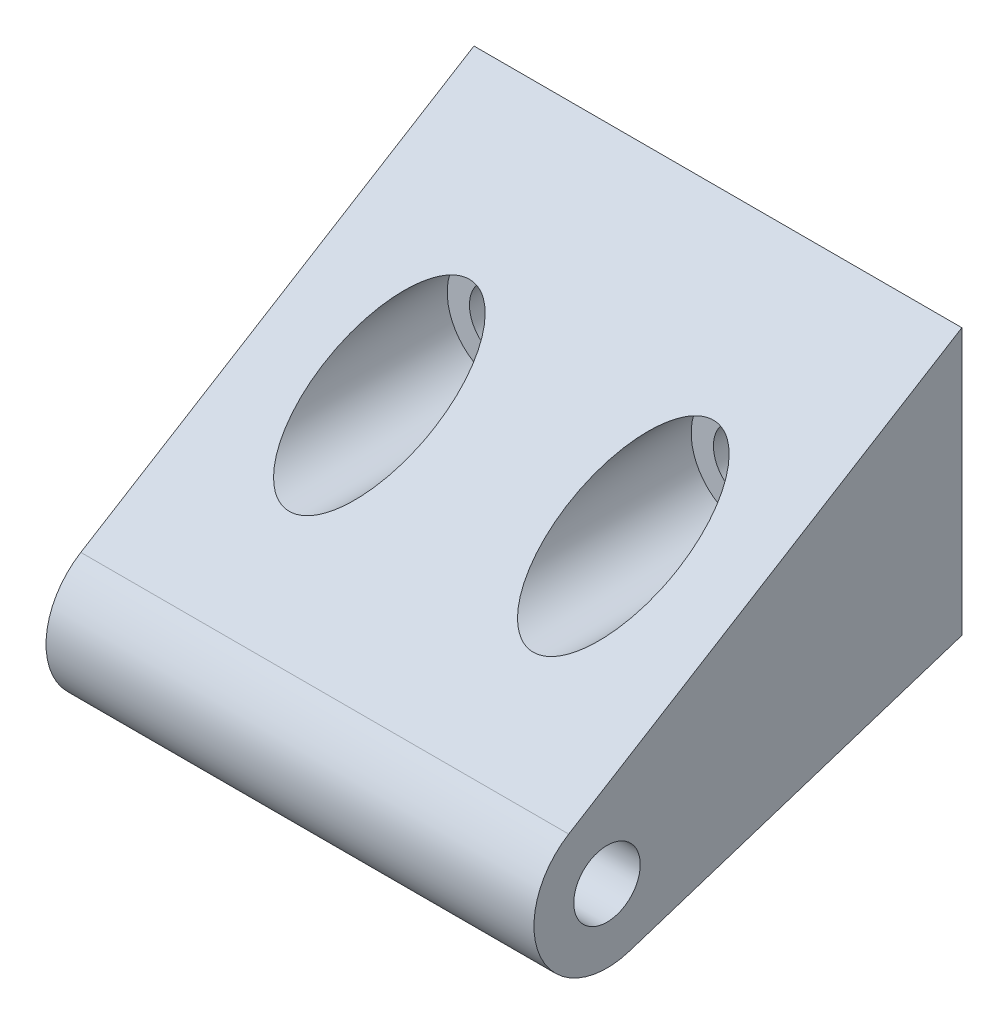
ISO-10303-21;
HEADER;
FILE_DESCRIPTION(('STEP AP214'),'2;1');
FILE_NAME('part.step','',(''),(''),'','','');
FILE_SCHEMA(('AUTOMOTIVE_DESIGN { 1 0 10303 214 1 1 1 1 }'));
ENDSEC;
DATA;
#1=APPLICATION_CONTEXT('core data for automotive mechanical design processes');
#2=APPLICATION_PROTOCOL_DEFINITION('international standard','automotive_design',2000,#1);
#3=PRODUCT_CONTEXT('',#1,'mechanical');
#4=PRODUCT('Part','Part','',(#3));
#5=PRODUCT_RELATED_PRODUCT_CATEGORY('part','',(#4));
#6=PRODUCT_DEFINITION_FORMATION('','',#4);
#7=PRODUCT_DEFINITION_CONTEXT('part definition',#1,'design');
#8=PRODUCT_DEFINITION('design','',#6,#7);
#9=PRODUCT_DEFINITION_SHAPE('','',#8);
#10=(LENGTH_UNIT() NAMED_UNIT(*) SI_UNIT(.MILLI.,.METRE.));
#11=(NAMED_UNIT(*) PLANE_ANGLE_UNIT() SI_UNIT($,.RADIAN.));
#12=(NAMED_UNIT(*) SI_UNIT($,.STERADIAN.) SOLID_ANGLE_UNIT());
#13=UNCERTAINTY_MEASURE_WITH_UNIT(LENGTH_MEASURE(1.E-05),#10,'distance_accuracy_value','');
#14=(GEOMETRIC_REPRESENTATION_CONTEXT(3) GLOBAL_UNCERTAINTY_ASSIGNED_CONTEXT((#13)) GLOBAL_UNIT_ASSIGNED_CONTEXT((#10,
#11,#12)) REPRESENTATION_CONTEXT('',''));
#15=CARTESIAN_POINT('',(0.,0.,0.));
#16=DIRECTION('',(0.,0.,1.));
#17=DIRECTION('',(1.,0.,0.));
#18=AXIS2_PLACEMENT_3D('',#15,#16,#17);
#19=CARTESIAN_POINT('',(-17.74444,2.26271294080112,-1.26438571596363));
#20=DIRECTION('',(0.,0.85165570406991,0.524101671171907));
#21=DIRECTION('',(0.,-0.524101671171907,0.85165570406991));
#22=AXIS2_PLACEMENT_3D('',#19,#20,#21);
#23=PLANE('',#22);
#24=CARTESIAN_POINT('',(-4.43738,6.21538000000002,-7.6873979527474));
#25=DIRECTION('',(0.,0.85165570406991,0.524101671171907));
#26=DIRECTION('',(0.,-0.524101671171907,0.85165570406991));
#27=AXIS2_PLACEMENT_3D('',#24,#25,#26);
#28=ELLIPSE('',#27,3.84803199633091,2.01676);
#29=CARTESIAN_POINT('',(-4.43738,4.19862000000002,-4.41019955362866));
#30=VERTEX_POINT('',#29);
#31=EDGE_CURVE('E35',#30,#30,#28,.T.);
#32=ORIENTED_EDGE('',*,*,#31,.F.);
#33=EDGE_LOOP('',(#32));
#34=FACE_BOUND('',#33,.T.);
#35=CARTESIAN_POINT('',(-13.3096,6.21538000000002,-7.6873979527474));
#36=DIRECTION('',(0.,0.85165570406991,0.524101671171907));
#37=DIRECTION('',(0.,-0.524101671171907,0.85165570406991));
#38=AXIS2_PLACEMENT_3D('',#35,#36,#37);
#39=ELLIPSE('',#38,3.84803199633092,2.01676);
#40=CARTESIAN_POINT('',(-13.3096,4.19862000000001,-4.41019955362865));
#41=VERTEX_POINT('',#40);
#42=EDGE_CURVE('E109',#41,#41,#39,.T.);
#43=ORIENTED_EDGE('',*,*,#42,.F.);
#44=EDGE_LOOP('',(#43));
#45=FACE_BOUND('',#44,.T.);
#46=DIRECTION('',(0.,-0.524101671171907,0.85165570406991));
#47=VECTOR('',#46,1.);
#48=CARTESIAN_POINT('',(0.,2.26271294080112,-1.26438571596363));
#49=LINE('',#48,#47);
#50=CARTESIAN_POINT('',(0.,11.0617,-15.56258));
#51=VERTEX_POINT('',#50);
#52=CARTESIAN_POINT('',(0.,2.26271294080112,-1.26438571596363));
#53=VERTEX_POINT('',#52);
#54=EDGE_CURVE('E99',#51,#53,#49,.T.);
#55=ORIENTED_EDGE('',*,*,#54,.F.);
#56=DIRECTION('',(1.,0.,0.));
#57=VECTOR('',#56,1.);
#58=CARTESIAN_POINT('',(-17.74444,11.0617,-15.56258));
#59=LINE('',#58,#57);
#60=CARTESIAN_POINT('',(-17.74444,11.0617,-15.56258));
#61=VERTEX_POINT('',#60);
#62=EDGE_CURVE('E11',#61,#51,#59,.T.);
#63=ORIENTED_EDGE('',*,*,#62,.F.);
#64=DIRECTION('',(0.,-0.524101671171907,0.85165570406991));
#65=VECTOR('',#64,1.);
#66=CARTESIAN_POINT('',(-17.74444,2.26271294080112,-1.26438571596363));
#67=LINE('',#66,#65);
#68=CARTESIAN_POINT('',(-17.74444,2.26271294080112,-1.26438571596363));
#69=VERTEX_POINT('',#68);
#70=EDGE_CURVE('E92',#61,#69,#67,.T.);
#71=ORIENTED_EDGE('',*,*,#70,.T.);
#72=DIRECTION('',(1.,0.,0.));
#73=VECTOR('',#72,1.);
#74=CARTESIAN_POINT('',(-17.74444,2.26271294080112,-1.26438571596363));
#75=LINE('',#74,#73);
#76=EDGE_CURVE('E75',#69,#53,#75,.T.);
#77=ORIENTED_EDGE('',*,*,#76,.T.);
#78=EDGE_LOOP('',(#55,#63,#71,#77));
#79=FACE_BOUND('',#78,.T.);
#80=ADVANCED_FACE('F32',(#34,#45,#79),#23,.T.);
#81=CARTESIAN_POINT('',(-17.74444,11.0617,-15.56258));
#82=DIRECTION('',(0.,0.,-1.));
#83=DIRECTION('',(-1.,0.,0.));
#84=AXIS2_PLACEMENT_3D('',#81,#82,#83);
#85=PLANE('',#84);
#86=CARTESIAN_POINT('',(-4.43738,6.21538000000002,-15.56258));
#87=DIRECTION('',(0.,0.,1.));
#88=DIRECTION('',(1.,0.,0.));
#89=AXIS2_PLACEMENT_3D('',#86,#87,#88);
#90=CIRCLE('',#89,1.20904);
#91=CARTESIAN_POINT('',(-3.22834,6.21538000000002,-15.56258));
#92=VERTEX_POINT('',#91);
#93=EDGE_CURVE('E185',#92,#92,#90,.T.);
#94=ORIENTED_EDGE('',*,*,#93,.T.);
#95=EDGE_LOOP('',(#94));
#96=FACE_BOUND('',#95,.T.);
#97=CARTESIAN_POINT('',(-13.3096,6.21538000000002,-15.56258));
#98=DIRECTION('',(0.,0.,1.));
#99=DIRECTION('',(1.,0.,0.));
#100=AXIS2_PLACEMENT_3D('',#97,#98,#99);
#101=CIRCLE('',#100,1.20904);
#102=CARTESIAN_POINT('',(-12.10056,6.21538000000002,-15.56258));
#103=VERTEX_POINT('',#102);
#104=EDGE_CURVE('E193',#103,#103,#101,.T.);
#105=ORIENTED_EDGE('',*,*,#104,.T.);
#106=EDGE_LOOP('',(#105));
#107=FACE_BOUND('',#106,.T.);
#108=DIRECTION('',(0.,1.,0.));
#109=VECTOR('',#108,1.);
#110=CARTESIAN_POINT('',(0.,11.0617,-15.56258));
#111=LINE('',#110,#109);
#112=CARTESIAN_POINT('',(0.,1.37160000000002,-15.56258));
#113=VERTEX_POINT('',#112);
#114=EDGE_CURVE('E94',#113,#51,#111,.T.);
#115=ORIENTED_EDGE('',*,*,#114,.F.);
#116=DIRECTION('',(1.,0.,0.));
#117=VECTOR('',#116,1.);
#118=CARTESIAN_POINT('',(-17.74444,1.37160000000002,-15.56258));
#119=LINE('',#118,#117);
#120=CARTESIAN_POINT('',(-17.74444,1.37160000000002,-15.56258));
#121=VERTEX_POINT('',#120);
#122=EDGE_CURVE('E41',#121,#113,#119,.T.);
#123=ORIENTED_EDGE('',*,*,#122,.F.);
#124=DIRECTION('',(0.,1.,0.));
#125=VECTOR('',#124,1.);
#126=CARTESIAN_POINT('',(-17.74444,11.0617,-15.56258));
#127=LINE('',#126,#125);
#128=EDGE_CURVE('E89',#121,#61,#127,.T.);
#129=ORIENTED_EDGE('',*,*,#128,.T.);
#130=ORIENTED_EDGE('',*,*,#62,.T.);
#131=EDGE_LOOP('',(#115,#123,#129,#130));
#132=FACE_BOUND('',#131,.T.);
#133=ADVANCED_FACE('F140',(#96,#107,#132),#85,.T.);
#134=CARTESIAN_POINT('',(-17.74444,1.37160000000002,-15.56258));
#135=DIRECTION('',(0.,-0.951706068554315,-0.307010682349799));
#136=DIRECTION('',(0.,0.307010682349799,-0.951706068554315));
#137=AXIS2_PLACEMENT_3D('',#134,#135,#136);
#138=PLANE('',#137);
#139=DIRECTION('',(0.,0.307010682349799,-0.951706068554315));
#140=VECTOR('',#139,1.);
#141=CARTESIAN_POINT('',(0.,1.37160000000002,-15.56258));
#142=LINE('',#141,#140);
#143=CARTESIAN_POINT('',(0.,-2.52853075117783,-3.47251826129424));
#144=VERTEX_POINT('',#143);
#145=EDGE_CURVE('E83',#144,#113,#142,.T.);
#146=ORIENTED_EDGE('',*,*,#145,.F.);
#147=DIRECTION('',(1.,0.,0.));
#148=VECTOR('',#147,1.);
#149=CARTESIAN_POINT('',(-17.74444,-2.52853075117783,-3.47251826129424));
#150=LINE('',#149,#148);
#151=CARTESIAN_POINT('',(-17.74444,-2.52853075117783,-3.47251826129424));
#152=VERTEX_POINT('',#151);
#153=EDGE_CURVE('E78',#152,#144,#150,.T.);
#154=ORIENTED_EDGE('',*,*,#153,.F.);
#155=DIRECTION('',(0.,0.307010682349799,-0.951706068554315));
#156=VECTOR('',#155,1.);
#157=CARTESIAN_POINT('',(-17.74444,1.37160000000002,-15.56258));
#158=LINE('',#157,#156);
#159=EDGE_CURVE('E81',#152,#121,#158,.T.);
#160=ORIENTED_EDGE('',*,*,#159,.T.);
#161=ORIENTED_EDGE('',*,*,#122,.T.);
#162=EDGE_LOOP('',(#146,#154,#160,#161));
#163=FACE_BOUND('',#162,.T.);
#164=ADVANCED_FACE('F80',(#163),#138,.T.);
#165=CARTESIAN_POINT('',(-17.74444,0.,-2.65684));
#166=DIRECTION('',(1.,0.,0.));
#167=DIRECTION('',(0.,0.,-1.));
#168=AXIS2_PLACEMENT_3D('',#165,#166,#167);
#169=CYLINDRICAL_SURFACE('',#168,2.65684);
#170=CARTESIAN_POINT('',(0.,0.,-2.65684));
#171=DIRECTION('',(1.,0.,0.));
#172=DIRECTION('',(0.,0.,-1.));
#173=AXIS2_PLACEMENT_3D('',#170,#171,#172);
#174=CIRCLE('',#173,2.65684);
#175=EDGE_CURVE('E102',#53,#144,#174,.T.);
#176=ORIENTED_EDGE('',*,*,#175,.F.);
#177=ORIENTED_EDGE('',*,*,#76,.F.);
#178=CARTESIAN_POINT('',(-17.74444,0.,-2.65684));
#179=DIRECTION('',(1.,0.,0.));
#180=DIRECTION('',(0.,0.,-1.));
#181=AXIS2_PLACEMENT_3D('',#178,#179,#180);
#182=CIRCLE('',#181,2.65684);
#183=EDGE_CURVE('E88',#69,#152,#182,.T.);
#184=ORIENTED_EDGE('',*,*,#183,.T.);
#185=ORIENTED_EDGE('',*,*,#153,.T.);
#186=EDGE_LOOP('',(#176,#177,#184,#185));
#187=FACE_BOUND('',#186,.T.);
#188=ADVANCED_FACE('F91',(#187),#169,.T.);
#189=CARTESIAN_POINT('',(-17.74444,0.,-2.65684));
#190=DIRECTION('',(1.,0.,0.));
#191=DIRECTION('',(0.,0.,-1.));
#192=AXIS2_PLACEMENT_3D('',#189,#190,#191);
#193=PLANE('',#192);
#194=CARTESIAN_POINT('',(-17.74444,0.,-2.65684));
#195=DIRECTION('',(1.,0.,0.));
#196=DIRECTION('',(0.,0.,-1.));
#197=AXIS2_PLACEMENT_3D('',#194,#195,#196);
#198=CIRCLE('',#197,1.20904);
#199=CARTESIAN_POINT('',(-17.74444,0.,-3.86588));
#200=VERTEX_POINT('',#199);
#201=EDGE_CURVE('E103',#200,#200,#198,.T.);
#202=ORIENTED_EDGE('',*,*,#201,.T.);
#203=EDGE_LOOP('',(#202));
#204=FACE_BOUND('',#203,.T.);
#205=ORIENTED_EDGE('',*,*,#70,.F.);
#206=ORIENTED_EDGE('',*,*,#128,.F.);
#207=ORIENTED_EDGE('',*,*,#159,.F.);
#208=ORIENTED_EDGE('',*,*,#183,.F.);
#209=EDGE_LOOP('',(#205,#206,#207,#208));
#210=FACE_BOUND('',#209,.T.);
#211=ADVANCED_FACE('F87',(#204,#210),#193,.F.);
#212=CARTESIAN_POINT('',(0.,0.,-2.65684));
#213=DIRECTION('',(1.,0.,0.));
#214=DIRECTION('',(0.,0.,-1.));
#215=AXIS2_PLACEMENT_3D('',#212,#213,#214);
#216=PLANE('',#215);
#217=CARTESIAN_POINT('',(0.,0.,-2.65684));
#218=DIRECTION('',(1.,0.,0.));
#219=DIRECTION('',(0.,0.,-1.));
#220=AXIS2_PLACEMENT_3D('',#217,#218,#219);
#221=CIRCLE('',#220,1.20904);
#222=CARTESIAN_POINT('',(0.,0.,-3.86588));
#223=VERTEX_POINT('',#222);
#224=EDGE_CURVE('E111',#223,#223,#221,.T.);
#225=ORIENTED_EDGE('',*,*,#224,.F.);
#226=EDGE_LOOP('',(#225));
#227=FACE_BOUND('',#226,.T.);
#228=ORIENTED_EDGE('',*,*,#54,.T.);
#229=ORIENTED_EDGE('',*,*,#175,.T.);
#230=ORIENTED_EDGE('',*,*,#145,.T.);
#231=ORIENTED_EDGE('',*,*,#114,.T.);
#232=EDGE_LOOP('',(#228,#229,#230,#231));
#233=FACE_BOUND('',#232,.T.);
#234=ADVANCED_FACE('F133',(#227,#233),#216,.T.);
#235=CARTESIAN_POINT('',(-17.74444,0.,-2.65684));
#236=DIRECTION('',(1.,0.,0.));
#237=DIRECTION('',(0.,0.,-1.));
#238=AXIS2_PLACEMENT_3D('',#235,#236,#237);
#239=CYLINDRICAL_SURFACE('',#238,1.20904);
#240=ORIENTED_EDGE('',*,*,#201,.F.);
#241=EDGE_LOOP('',(#240));
#242=FACE_BOUND('',#241,.T.);
#243=ORIENTED_EDGE('',*,*,#224,.T.);
#244=EDGE_LOOP('',(#243));
#245=FACE_BOUND('',#244,.T.);
#246=ADVANCED_FACE('F129',(#242,#245),#239,.F.);
#247=CARTESIAN_POINT('',(-13.3096,6.21538000000002,-12.17243946));
#248=DIRECTION('',(0.,0.,1.));
#249=DIRECTION('',(1.,0.,0.));
#250=AXIS2_PLACEMENT_3D('',#247,#248,#249);
#251=CYLINDRICAL_SURFACE('',#250,2.01676);
#252=ORIENTED_EDGE('',*,*,#42,.T.);
#253=EDGE_LOOP('',(#252));
#254=FACE_BOUND('',#253,.T.);
#255=CARTESIAN_POINT('',(-13.3096,6.21538000000002,-12.17243946));
#256=DIRECTION('',(0.,0.,1.));
#257=DIRECTION('',(1.,0.,0.));
#258=AXIS2_PLACEMENT_3D('',#255,#256,#257);
#259=CIRCLE('',#258,2.01676);
#260=CARTESIAN_POINT('',(-11.29284,6.21538000000002,-12.17243946));
#261=VERTEX_POINT('',#260);
#262=EDGE_CURVE('E112',#261,#261,#259,.T.);
#263=ORIENTED_EDGE('',*,*,#262,.F.);
#264=EDGE_LOOP('',(#263));
#265=FACE_BOUND('',#264,.T.);
#266=ADVANCED_FACE('F132',(#254,#265),#251,.F.);
#267=CARTESIAN_POINT('',(-13.3096,6.21538000000002,-12.17243946));
#268=DIRECTION('',(0.,0.,1.));
#269=DIRECTION('',(1.,0.,0.));
#270=AXIS2_PLACEMENT_3D('',#267,#268,#269);
#271=PLANE('',#270);
#272=CARTESIAN_POINT('',(-13.3096,6.21538000000002,-12.17243946));
#273=DIRECTION('',(0.,0.,1.));
#274=DIRECTION('',(1.,0.,0.));
#275=AXIS2_PLACEMENT_3D('',#272,#273,#274);
#276=CIRCLE('',#275,1.20904);
#277=CARTESIAN_POINT('',(-12.10056,6.21538000000002,-12.17243946));
#278=VERTEX_POINT('',#277);
#279=EDGE_CURVE('E190',#278,#278,#276,.T.);
#280=ORIENTED_EDGE('',*,*,#279,.F.);
#281=EDGE_LOOP('',(#280));
#282=FACE_BOUND('',#281,.T.);
#283=ORIENTED_EDGE('',*,*,#262,.T.);
#284=EDGE_LOOP('',(#283));
#285=FACE_BOUND('',#284,.T.);
#286=ADVANCED_FACE('F162',(#282,#285),#271,.T.);
#287=CARTESIAN_POINT('',(-4.43738,6.21538000000002,-12.17243946));
#288=DIRECTION('',(0.,0.,1.));
#289=DIRECTION('',(1.,0.,0.));
#290=AXIS2_PLACEMENT_3D('',#287,#288,#289);
#291=CYLINDRICAL_SURFACE('',#290,2.01676);
#292=ORIENTED_EDGE('',*,*,#31,.T.);
#293=EDGE_LOOP('',(#292));
#294=FACE_BOUND('',#293,.T.);
#295=CARTESIAN_POINT('',(-4.43738,6.21538000000002,-12.17243946));
#296=DIRECTION('',(0.,0.,1.));
#297=DIRECTION('',(1.,0.,0.));
#298=AXIS2_PLACEMENT_3D('',#295,#296,#297);
#299=CIRCLE('',#298,2.01676);
#300=CARTESIAN_POINT('',(-2.42062,6.21538000000002,-12.17243946));
#301=VERTEX_POINT('',#300);
#302=EDGE_CURVE('E121',#301,#301,#299,.T.);
#303=ORIENTED_EDGE('',*,*,#302,.F.);
#304=EDGE_LOOP('',(#303));
#305=FACE_BOUND('',#304,.T.);
#306=ADVANCED_FACE('F165',(#294,#305),#291,.F.);
#307=CARTESIAN_POINT('',(-4.43738,6.21538000000002,-12.17243946));
#308=DIRECTION('',(0.,0.,1.));
#309=DIRECTION('',(1.,0.,0.));
#310=AXIS2_PLACEMENT_3D('',#307,#308,#309);
#311=PLANE('',#310);
#312=CARTESIAN_POINT('',(-4.43738,6.21538000000002,-12.17243946));
#313=DIRECTION('',(0.,0.,1.));
#314=DIRECTION('',(1.,0.,0.));
#315=AXIS2_PLACEMENT_3D('',#312,#313,#314);
#316=CIRCLE('',#315,1.20904);
#317=CARTESIAN_POINT('',(-3.22834,6.21538000000002,-12.17243946));
#318=VERTEX_POINT('',#317);
#319=EDGE_CURVE('E188',#318,#318,#316,.T.);
#320=ORIENTED_EDGE('',*,*,#319,.F.);
#321=EDGE_LOOP('',(#320));
#322=FACE_BOUND('',#321,.T.);
#323=ORIENTED_EDGE('',*,*,#302,.T.);
#324=EDGE_LOOP('',(#323));
#325=FACE_BOUND('',#324,.T.);
#326=ADVANCED_FACE('F169',(#322,#325),#311,.T.);
#327=CARTESIAN_POINT('',(-13.3096,6.21538000000002,-15.56258));
#328=DIRECTION('',(0.,0.,1.));
#329=DIRECTION('',(1.,0.,0.));
#330=AXIS2_PLACEMENT_3D('',#327,#328,#329);
#331=CYLINDRICAL_SURFACE('',#330,1.20904);
#332=ORIENTED_EDGE('',*,*,#104,.F.);
#333=EDGE_LOOP('',(#332));
#334=FACE_BOUND('',#333,.T.);
#335=ORIENTED_EDGE('',*,*,#279,.T.);
#336=EDGE_LOOP('',(#335));
#337=FACE_BOUND('',#336,.T.);
#338=ADVANCED_FACE('F173',(#334,#337),#331,.F.);
#339=CARTESIAN_POINT('',(-4.43738,6.21538000000002,-15.56258));
#340=DIRECTION('',(0.,0.,1.));
#341=DIRECTION('',(1.,0.,0.));
#342=AXIS2_PLACEMENT_3D('',#339,#340,#341);
#343=CYLINDRICAL_SURFACE('',#342,1.20904);
#344=ORIENTED_EDGE('',*,*,#93,.F.);
#345=EDGE_LOOP('',(#344));
#346=FACE_BOUND('',#345,.T.);
#347=ORIENTED_EDGE('',*,*,#319,.T.);
#348=EDGE_LOOP('',(#347));
#349=FACE_BOUND('',#348,.T.);
#350=ADVANCED_FACE('F177',(#346,#349),#343,.F.);
#351=CLOSED_SHELL('',(#80,#133,#164,#188,#211,#234,#246,#266,#286,#306,#326,#338,#350));
#352=MANIFOLD_SOLID_BREP('B2',#351);
#353=ADVANCED_BREP_SHAPE_REPRESENTATION('',(#18,#352),#14);
#354=SHAPE_DEFINITION_REPRESENTATION(#9,#353);
ENDSEC;
END-ISO-10303-21;
